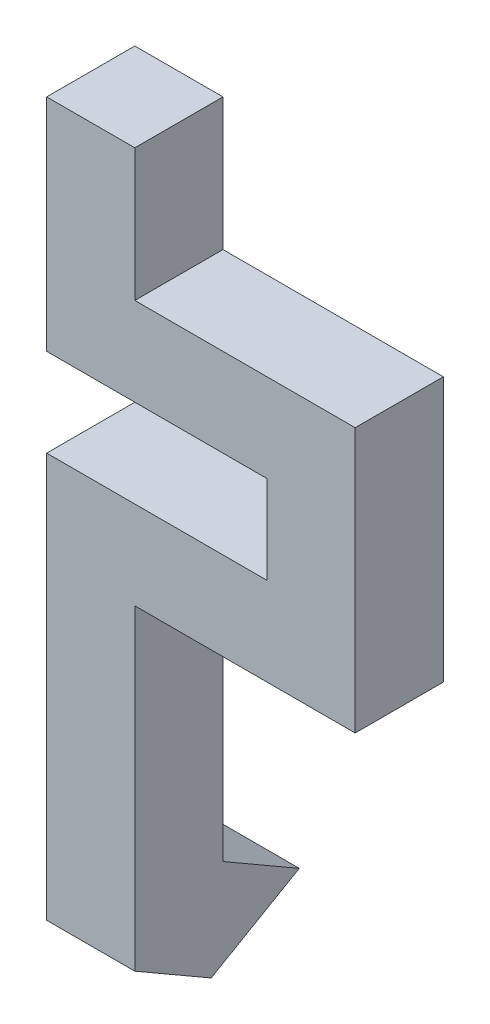
ISO-10303-21;
HEADER;
FILE_DESCRIPTION(('STEP AP214'),'2;1');
FILE_NAME('part.step','',(''),(''),'','','');
FILE_SCHEMA(('AUTOMOTIVE_DESIGN { 1 0 10303 214 1 1 1 1 }'));
ENDSEC;
DATA;
#1=APPLICATION_CONTEXT('core data for automotive mechanical design processes');
#2=APPLICATION_PROTOCOL_DEFINITION('international standard','automotive_design',2000,#1);
#3=PRODUCT_CONTEXT('',#1,'mechanical');
#4=PRODUCT('Part','Part','',(#3));
#5=PRODUCT_RELATED_PRODUCT_CATEGORY('part','',(#4));
#6=PRODUCT_DEFINITION_FORMATION('','',#4);
#7=PRODUCT_DEFINITION_CONTEXT('part definition',#1,'design');
#8=PRODUCT_DEFINITION('design','',#6,#7);
#9=PRODUCT_DEFINITION_SHAPE('','',#8);
#10=(LENGTH_UNIT() NAMED_UNIT(*) SI_UNIT(.MILLI.,.METRE.));
#11=(NAMED_UNIT(*) PLANE_ANGLE_UNIT() SI_UNIT($,.RADIAN.));
#12=(NAMED_UNIT(*) SI_UNIT($,.STERADIAN.) SOLID_ANGLE_UNIT());
#13=UNCERTAINTY_MEASURE_WITH_UNIT(LENGTH_MEASURE(1.E-05),#10,'distance_accuracy_value','');
#14=(GEOMETRIC_REPRESENTATION_CONTEXT(3) GLOBAL_UNCERTAINTY_ASSIGNED_CONTEXT((#13)) GLOBAL_UNIT_ASSIGNED_CONTEXT((#10,
#11,#12)) REPRESENTATION_CONTEXT('',''));
#15=CARTESIAN_POINT('',(0.,0.,0.));
#16=DIRECTION('',(0.,0.,1.));
#17=DIRECTION('',(1.,0.,0.));
#18=AXIS2_PLACEMENT_3D('',#15,#16,#17);
#19=CARTESIAN_POINT('',(2.,0.,2.));
#20=DIRECTION('',(1.,0.,0.));
#21=DIRECTION('',(0.,1.,0.));
#22=AXIS2_PLACEMENT_3D('',#19,#20,#21);
#23=PLANE('',#22);
#24=DIRECTION('',(0.,-1.,0.));
#25=VECTOR('',#24,1.);
#26=CARTESIAN_POINT('',(2.,0.,2.));
#27=LINE('',#26,#25);
#28=CARTESIAN_POINT('',(2.,-9.,2.));
#29=VERTEX_POINT('',#28);
#30=CARTESIAN_POINT('',(2.,-16.18,2.));
#31=VERTEX_POINT('',#30);
#32=EDGE_CURVE('E180',#29,#31,#27,.T.);
#33=ORIENTED_EDGE('',*,*,#32,.T.);
#34=DIRECTION('',(0.,0.499999999999999,0.866025403784439));
#35=VECTOR('',#34,1.);
#36=CARTESIAN_POINT('',(2.,-16.18,2.));
#37=LINE('',#36,#35);
#38=CARTESIAN_POINT('',(2.,-17.18,0.267949192431121));
#39=VERTEX_POINT('',#38);
#40=EDGE_CURVE('E247',#39,#31,#37,.T.);
#41=ORIENTED_EDGE('',*,*,#40,.F.);
#42=DIRECTION('',(0.,-0.500000000000003,0.866025403784437));
#43=VECTOR('',#42,1.);
#44=CARTESIAN_POINT('',(2.,-16.0252994616207,-1.73205080756887));
#45=LINE('',#44,#43);
#46=CARTESIAN_POINT('',(2.,-16.0252994616207,-1.73205080756887));
#47=VERTEX_POINT('',#46);
#48=EDGE_CURVE('E269',#47,#39,#45,.T.);
#49=ORIENTED_EDGE('',*,*,#48,.F.);
#50=DIRECTION('',(0.,-0.5,-0.866025403784439));
#51=VECTOR('',#50,1.);
#52=CARTESIAN_POINT('',(2.,-15.0252994616207,0.));
#53=LINE('',#52,#51);
#54=CARTESIAN_POINT('',(2.,-15.0252994616207,0.));
#55=VERTEX_POINT('',#54);
#56=EDGE_CURVE('E261',#55,#47,#53,.T.);
#57=ORIENTED_EDGE('',*,*,#56,.F.);
#58=DIRECTION('',(0.,-1.,0.));
#59=VECTOR('',#58,1.);
#60=CARTESIAN_POINT('',(2.,0.,0.));
#61=LINE('',#60,#59);
#62=CARTESIAN_POINT('',(2.,-9.,0.));
#63=VERTEX_POINT('',#62);
#64=EDGE_CURVE('E153',#63,#55,#61,.T.);
#65=ORIENTED_EDGE('',*,*,#64,.F.);
#66=DIRECTION('',(0.,0.,-1.));
#67=VECTOR('',#66,1.);
#68=CARTESIAN_POINT('',(2.,-9.,2.));
#69=LINE('',#68,#67);
#70=EDGE_CURVE('E11',#29,#63,#69,.T.);
#71=ORIENTED_EDGE('',*,*,#70,.F.);
#72=EDGE_LOOP('',(#33,#41,#49,#57,#65,#71));
#73=FACE_BOUND('',#72,.T.);
#74=ADVANCED_FACE('F35',(#73),#23,.T.);
#75=CARTESIAN_POINT('',(0.,-9.,2.));
#76=DIRECTION('',(0.,-1.,0.));
#77=DIRECTION('',(0.,0.,-1.));
#78=AXIS2_PLACEMENT_3D('',#75,#76,#77);
#79=PLANE('',#78);
#80=DIRECTION('',(-1.,0.,0.));
#81=VECTOR('',#80,1.);
#82=CARTESIAN_POINT('',(0.,-9.,0.));
#83=LINE('',#82,#81);
#84=CARTESIAN_POINT('',(7.,-9.,0.));
#85=VERTEX_POINT('',#84);
#86=EDGE_CURVE('E156',#85,#63,#83,.T.);
#87=ORIENTED_EDGE('',*,*,#86,.F.);
#88=DIRECTION('',(0.,0.,-1.));
#89=VECTOR('',#88,1.);
#90=CARTESIAN_POINT('',(7.,-9.,2.));
#91=LINE('',#90,#89);
#92=CARTESIAN_POINT('',(7.,-9.,2.));
#93=VERTEX_POINT('',#92);
#94=EDGE_CURVE('E43',#93,#85,#91,.T.);
#95=ORIENTED_EDGE('',*,*,#94,.F.);
#96=DIRECTION('',(-1.,0.,0.));
#97=VECTOR('',#96,1.);
#98=CARTESIAN_POINT('',(0.,-9.,2.));
#99=LINE('',#98,#97);
#100=EDGE_CURVE('E213',#93,#29,#99,.T.);
#101=ORIENTED_EDGE('',*,*,#100,.T.);
#102=ORIENTED_EDGE('',*,*,#70,.T.);
#103=EDGE_LOOP('',(#87,#95,#101,#102));
#104=FACE_BOUND('',#103,.T.);
#105=ADVANCED_FACE('F201',(#104),#79,.T.);
#106=CARTESIAN_POINT('',(7.,0.,2.));
#107=DIRECTION('',(1.,0.,0.));
#108=DIRECTION('',(0.,1.,0.));
#109=AXIS2_PLACEMENT_3D('',#106,#107,#108);
#110=PLANE('',#109);
#111=DIRECTION('',(0.,-1.,0.));
#112=VECTOR('',#111,1.);
#113=CARTESIAN_POINT('',(7.,0.,0.));
#114=LINE('',#113,#112);
#115=CARTESIAN_POINT('',(7.,-3.,0.));
#116=VERTEX_POINT('',#115);
#117=EDGE_CURVE('E160',#116,#85,#114,.T.);
#118=ORIENTED_EDGE('',*,*,#117,.F.);
#119=DIRECTION('',(0.,0.,-1.));
#120=VECTOR('',#119,1.);
#121=CARTESIAN_POINT('',(7.,-3.,2.));
#122=LINE('',#121,#120);
#123=CARTESIAN_POINT('',(7.,-3.,2.));
#124=VERTEX_POINT('',#123);
#125=EDGE_CURVE('E190',#124,#116,#122,.T.);
#126=ORIENTED_EDGE('',*,*,#125,.F.);
#127=DIRECTION('',(0.,-1.,0.));
#128=VECTOR('',#127,1.);
#129=CARTESIAN_POINT('',(7.,0.,2.));
#130=LINE('',#129,#128);
#131=EDGE_CURVE('E197',#124,#93,#130,.T.);
#132=ORIENTED_EDGE('',*,*,#131,.T.);
#133=ORIENTED_EDGE('',*,*,#94,.T.);
#134=EDGE_LOOP('',(#118,#126,#132,#133));
#135=FACE_BOUND('',#134,.T.);
#136=ADVANCED_FACE('F195',(#135),#110,.T.);
#137=CARTESIAN_POINT('',(0.,-3.,2.));
#138=DIRECTION('',(0.,1.,0.));
#139=DIRECTION('',(0.,0.,1.));
#140=AXIS2_PLACEMENT_3D('',#137,#138,#139);
#141=PLANE('',#140);
#142=DIRECTION('',(1.,0.,0.));
#143=VECTOR('',#142,1.);
#144=CARTESIAN_POINT('',(0.,-3.,0.));
#145=LINE('',#144,#143);
#146=CARTESIAN_POINT('',(2.,-3.,0.));
#147=VERTEX_POINT('',#146);
#148=EDGE_CURVE('E163',#147,#116,#145,.T.);
#149=ORIENTED_EDGE('',*,*,#148,.F.);
#150=DIRECTION('',(0.,0.,-1.));
#151=VECTOR('',#150,1.);
#152=CARTESIAN_POINT('',(2.,-3.,2.));
#153=LINE('',#152,#151);
#154=CARTESIAN_POINT('',(2.,-3.,2.));
#155=VERTEX_POINT('',#154);
#156=EDGE_CURVE('E188',#155,#147,#153,.T.);
#157=ORIENTED_EDGE('',*,*,#156,.F.);
#158=DIRECTION('',(1.,0.,0.));
#159=VECTOR('',#158,1.);
#160=CARTESIAN_POINT('',(0.,-3.,2.));
#161=LINE('',#160,#159);
#162=EDGE_CURVE('E210',#155,#124,#161,.T.);
#163=ORIENTED_EDGE('',*,*,#162,.T.);
#164=ORIENTED_EDGE('',*,*,#125,.T.);
#165=EDGE_LOOP('',(#149,#157,#163,#164));
#166=FACE_BOUND('',#165,.T.);
#167=ADVANCED_FACE('F207',(#166),#141,.T.);
#168=CARTESIAN_POINT('',(2.,0.,2.));
#169=DIRECTION('',(1.,0.,0.));
#170=DIRECTION('',(0.,1.,0.));
#171=AXIS2_PLACEMENT_3D('',#168,#169,#170);
#172=PLANE('',#171);
#173=DIRECTION('',(0.,-1.,0.));
#174=VECTOR('',#173,1.);
#175=CARTESIAN_POINT('',(2.,0.,0.));
#176=LINE('',#175,#174);
#177=CARTESIAN_POINT('',(2.,0.,0.));
#178=VERTEX_POINT('',#177);
#179=EDGE_CURVE('E166',#178,#147,#176,.T.);
#180=ORIENTED_EDGE('',*,*,#179,.F.);
#181=DIRECTION('',(0.,0.,-1.));
#182=VECTOR('',#181,1.);
#183=CARTESIAN_POINT('',(2.,0.,2.));
#184=LINE('',#183,#182);
#185=CARTESIAN_POINT('',(2.,0.,2.));
#186=VERTEX_POINT('',#185);
#187=EDGE_CURVE('E186',#186,#178,#184,.T.);
#188=ORIENTED_EDGE('',*,*,#187,.F.);
#189=DIRECTION('',(0.,-1.,0.));
#190=VECTOR('',#189,1.);
#191=CARTESIAN_POINT('',(2.,0.,2.));
#192=LINE('',#191,#190);
#193=EDGE_CURVE('E215',#186,#155,#192,.T.);
#194=ORIENTED_EDGE('',*,*,#193,.T.);
#195=ORIENTED_EDGE('',*,*,#156,.T.);
#196=EDGE_LOOP('',(#180,#188,#194,#195));
#197=FACE_BOUND('',#196,.T.);
#198=ADVANCED_FACE('F227',(#197),#172,.T.);
#199=CARTESIAN_POINT('',(0.,0.,2.));
#200=DIRECTION('',(0.,1.,0.));
#201=DIRECTION('',(0.,0.,1.));
#202=AXIS2_PLACEMENT_3D('',#199,#200,#201);
#203=PLANE('',#202);
#204=DIRECTION('',(1.,0.,0.));
#205=VECTOR('',#204,1.);
#206=CARTESIAN_POINT('',(0.,0.,0.));
#207=LINE('',#206,#205);
#208=CARTESIAN_POINT('',(0.,0.,0.));
#209=VERTEX_POINT('',#208);
#210=EDGE_CURVE('E169',#209,#178,#207,.T.);
#211=ORIENTED_EDGE('',*,*,#210,.F.);
#212=DIRECTION('',(0.,0.,-1.));
#213=VECTOR('',#212,1.);
#214=CARTESIAN_POINT('',(0.,0.,2.));
#215=LINE('',#214,#213);
#216=CARTESIAN_POINT('',(0.,0.,2.));
#217=VERTEX_POINT('',#216);
#218=EDGE_CURVE('E184',#217,#209,#215,.T.);
#219=ORIENTED_EDGE('',*,*,#218,.F.);
#220=DIRECTION('',(1.,0.,0.));
#221=VECTOR('',#220,1.);
#222=CARTESIAN_POINT('',(0.,0.,2.));
#223=LINE('',#222,#221);
#224=EDGE_CURVE('E221',#217,#186,#223,.T.);
#225=ORIENTED_EDGE('',*,*,#224,.T.);
#226=ORIENTED_EDGE('',*,*,#187,.T.);
#227=EDGE_LOOP('',(#211,#219,#225,#226));
#228=FACE_BOUND('',#227,.T.);
#229=ADVANCED_FACE('F225',(#228),#203,.T.);
#230=CARTESIAN_POINT('',(0.,0.,2.));
#231=DIRECTION('',(1.,0.,0.));
#232=DIRECTION('',(0.,1.,0.));
#233=AXIS2_PLACEMENT_3D('',#230,#231,#232);
#234=PLANE('',#233);
#235=DIRECTION('',(0.,-1.,0.));
#236=VECTOR('',#235,1.);
#237=CARTESIAN_POINT('',(0.,0.,0.));
#238=LINE('',#237,#236);
#239=CARTESIAN_POINT('',(0.,-5.,0.));
#240=VERTEX_POINT('',#239);
#241=EDGE_CURVE('E172',#209,#240,#238,.T.);
#242=ORIENTED_EDGE('',*,*,#241,.T.);
#243=DIRECTION('',(0.,0.,-1.));
#244=VECTOR('',#243,1.);
#245=CARTESIAN_POINT('',(0.,-5.,2.));
#246=LINE('',#245,#244);
#247=CARTESIAN_POINT('',(0.,-5.,2.));
#248=VERTEX_POINT('',#247);
#249=EDGE_CURVE('E139',#248,#240,#246,.T.);
#250=ORIENTED_EDGE('',*,*,#249,.F.);
#251=DIRECTION('',(0.,-1.,0.));
#252=VECTOR('',#251,1.);
#253=CARTESIAN_POINT('',(0.,0.,2.));
#254=LINE('',#253,#252);
#255=EDGE_CURVE('E130',#217,#248,#254,.T.);
#256=ORIENTED_EDGE('',*,*,#255,.F.);
#257=ORIENTED_EDGE('',*,*,#218,.T.);
#258=EDGE_LOOP('',(#242,#250,#256,#257));
#259=FACE_BOUND('',#258,.T.);
#260=ADVANCED_FACE('F230',(#259),#234,.F.);
#261=CARTESIAN_POINT('',(0.,-5.,2.));
#262=DIRECTION('',(0.,1.,0.));
#263=DIRECTION('',(-1.,0.,0.));
#264=AXIS2_PLACEMENT_3D('',#261,#262,#263);
#265=PLANE('',#264);
#266=DIRECTION('',(1.,0.,0.));
#267=VECTOR('',#266,1.);
#268=CARTESIAN_POINT('',(0.,-5.,0.));
#269=LINE('',#268,#267);
#270=CARTESIAN_POINT('',(5.,-5.,0.));
#271=VERTEX_POINT('',#270);
#272=EDGE_CURVE('E138',#240,#271,#269,.T.);
#273=ORIENTED_EDGE('',*,*,#272,.T.);
#274=DIRECTION('',(0.,0.,-1.));
#275=VECTOR('',#274,1.);
#276=CARTESIAN_POINT('',(5.,-5.,2.));
#277=LINE('',#276,#275);
#278=CARTESIAN_POINT('',(5.,-5.,2.));
#279=VERTEX_POINT('',#278);
#280=EDGE_CURVE('E135',#279,#271,#277,.T.);
#281=ORIENTED_EDGE('',*,*,#280,.F.);
#282=DIRECTION('',(1.,0.,0.));
#283=VECTOR('',#282,1.);
#284=CARTESIAN_POINT('',(0.,-5.,2.));
#285=LINE('',#284,#283);
#286=EDGE_CURVE('E123',#248,#279,#285,.T.);
#287=ORIENTED_EDGE('',*,*,#286,.F.);
#288=ORIENTED_EDGE('',*,*,#249,.T.);
#289=EDGE_LOOP('',(#273,#281,#287,#288));
#290=FACE_BOUND('',#289,.T.);
#291=ADVANCED_FACE('F136',(#290),#265,.F.);
#292=CARTESIAN_POINT('',(5.,0.,2.));
#293=DIRECTION('',(1.,0.,0.));
#294=DIRECTION('',(0.,0.,-1.));
#295=AXIS2_PLACEMENT_3D('',#292,#293,#294);
#296=PLANE('',#295);
#297=DIRECTION('',(0.,-1.,0.));
#298=VECTOR('',#297,1.);
#299=CARTESIAN_POINT('',(5.,0.,0.));
#300=LINE('',#299,#298);
#301=CARTESIAN_POINT('',(5.,-7.,0.));
#302=VERTEX_POINT('',#301);
#303=EDGE_CURVE('E86',#271,#302,#300,.T.);
#304=ORIENTED_EDGE('',*,*,#303,.T.);
#305=DIRECTION('',(0.,0.,-1.));
#306=VECTOR('',#305,1.);
#307=CARTESIAN_POINT('',(5.,-7.,2.));
#308=LINE('',#307,#306);
#309=CARTESIAN_POINT('',(5.,-7.,2.));
#310=VERTEX_POINT('',#309);
#311=EDGE_CURVE('E140',#310,#302,#308,.T.);
#312=ORIENTED_EDGE('',*,*,#311,.F.);
#313=DIRECTION('',(0.,-1.,0.));
#314=VECTOR('',#313,1.);
#315=CARTESIAN_POINT('',(5.,0.,2.));
#316=LINE('',#315,#314);
#317=EDGE_CURVE('E127',#279,#310,#316,.T.);
#318=ORIENTED_EDGE('',*,*,#317,.F.);
#319=ORIENTED_EDGE('',*,*,#280,.T.);
#320=EDGE_LOOP('',(#304,#312,#318,#319));
#321=FACE_BOUND('',#320,.T.);
#322=ADVANCED_FACE('F142',(#321),#296,.F.);
#323=CARTESIAN_POINT('',(0.,-7.,2.));
#324=DIRECTION('',(0.,-1.,0.));
#325=DIRECTION('',(1.,0.,0.));
#326=AXIS2_PLACEMENT_3D('',#323,#324,#325);
#327=PLANE('',#326);
#328=DIRECTION('',(-1.,0.,0.));
#329=VECTOR('',#328,1.);
#330=CARTESIAN_POINT('',(0.,-7.,0.));
#331=LINE('',#330,#329);
#332=CARTESIAN_POINT('',(0.,-7.,0.));
#333=VERTEX_POINT('',#332);
#334=EDGE_CURVE('E92',#302,#333,#331,.T.);
#335=ORIENTED_EDGE('',*,*,#334,.T.);
#336=DIRECTION('',(0.,0.,-1.));
#337=VECTOR('',#336,1.);
#338=CARTESIAN_POINT('',(0.,-7.,2.));
#339=LINE('',#338,#337);
#340=CARTESIAN_POINT('',(0.,-7.,2.));
#341=VERTEX_POINT('',#340);
#342=EDGE_CURVE('E152',#341,#333,#339,.T.);
#343=ORIENTED_EDGE('',*,*,#342,.F.);
#344=DIRECTION('',(-1.,0.,0.));
#345=VECTOR('',#344,1.);
#346=CARTESIAN_POINT('',(0.,-7.,2.));
#347=LINE('',#346,#345);
#348=EDGE_CURVE('E51',#310,#341,#347,.T.);
#349=ORIENTED_EDGE('',*,*,#348,.F.);
#350=ORIENTED_EDGE('',*,*,#311,.T.);
#351=EDGE_LOOP('',(#335,#343,#349,#350));
#352=FACE_BOUND('',#351,.T.);
#353=ADVANCED_FACE('F291',(#352),#327,.F.);
#354=CARTESIAN_POINT('',(0.,0.,2.));
#355=DIRECTION('',(1.,0.,0.));
#356=DIRECTION('',(0.,1.,0.));
#357=AXIS2_PLACEMENT_3D('',#354,#355,#356);
#358=PLANE('',#357);
#359=DIRECTION('',(0.,-1.,0.));
#360=VECTOR('',#359,1.);
#361=CARTESIAN_POINT('',(0.,0.,0.));
#362=LINE('',#361,#360);
#363=CARTESIAN_POINT('',(0.,-15.0252994616207,0.));
#364=VERTEX_POINT('',#363);
#365=EDGE_CURVE('E177',#333,#364,#362,.T.);
#366=ORIENTED_EDGE('',*,*,#365,.T.);
#367=DIRECTION('',(0.,-0.5,-0.866025403784439));
#368=VECTOR('',#367,1.);
#369=CARTESIAN_POINT('',(0.,-15.0252994616207,0.));
#370=LINE('',#369,#368);
#371=CARTESIAN_POINT('',(0.,-16.0252994616207,-1.73205080756887));
#372=VERTEX_POINT('',#371);
#373=EDGE_CURVE('E265',#364,#372,#370,.T.);
#374=ORIENTED_EDGE('',*,*,#373,.T.);
#375=DIRECTION('',(0.,-0.500000000000003,0.866025403784437));
#376=VECTOR('',#375,1.);
#377=CARTESIAN_POINT('',(0.,-16.0252994616207,-1.73205080756887));
#378=LINE('',#377,#376);
#379=CARTESIAN_POINT('',(0.,-17.18,0.267949192431121));
#380=VERTEX_POINT('',#379);
#381=EDGE_CURVE('E262',#372,#380,#378,.T.);
#382=ORIENTED_EDGE('',*,*,#381,.T.);
#383=DIRECTION('',(0.,0.499999999999999,0.866025403784439));
#384=VECTOR('',#383,1.);
#385=CARTESIAN_POINT('',(0.,-16.18,2.));
#386=LINE('',#385,#384);
#387=CARTESIAN_POINT('',(0.,-16.18,2.));
#388=VERTEX_POINT('',#387);
#389=EDGE_CURVE('E258',#380,#388,#386,.T.);
#390=ORIENTED_EDGE('',*,*,#389,.T.);
#391=DIRECTION('',(0.,-1.,0.));
#392=VECTOR('',#391,1.);
#393=CARTESIAN_POINT('',(0.,0.,2.));
#394=LINE('',#393,#392);
#395=EDGE_CURVE('E144',#341,#388,#394,.T.);
#396=ORIENTED_EDGE('',*,*,#395,.F.);
#397=ORIENTED_EDGE('',*,*,#342,.T.);
#398=EDGE_LOOP('',(#366,#374,#382,#390,#396,#397));
#399=FACE_BOUND('',#398,.T.);
#400=ADVANCED_FACE('F289',(#399),#358,.F.);
#401=CARTESIAN_POINT('',(0.,0.,2.));
#402=DIRECTION('',(0.,0.,1.));
#403=DIRECTION('',(1.,0.,0.));
#404=AXIS2_PLACEMENT_3D('',#401,#402,#403);
#405=PLANE('',#404);
#406=ORIENTED_EDGE('',*,*,#32,.F.);
#407=ORIENTED_EDGE('',*,*,#100,.F.);
#408=ORIENTED_EDGE('',*,*,#131,.F.);
#409=ORIENTED_EDGE('',*,*,#162,.F.);
#410=ORIENTED_EDGE('',*,*,#193,.F.);
#411=ORIENTED_EDGE('',*,*,#224,.F.);
#412=ORIENTED_EDGE('',*,*,#255,.T.);
#413=ORIENTED_EDGE('',*,*,#286,.T.);
#414=ORIENTED_EDGE('',*,*,#317,.T.);
#415=ORIENTED_EDGE('',*,*,#348,.T.);
#416=ORIENTED_EDGE('',*,*,#395,.T.);
#417=DIRECTION('',(1.,0.,0.));
#418=VECTOR('',#417,1.);
#419=CARTESIAN_POINT('',(0.,-16.18,2.));
#420=LINE('',#419,#418);
#421=EDGE_CURVE('E149',#388,#31,#420,.T.);
#422=ORIENTED_EDGE('',*,*,#421,.T.);
#423=EDGE_LOOP('',(#406,#407,#408,#409,#410,#411,#412,#413,#414,#415,#416,#422));
#424=FACE_BOUND('',#423,.T.);
#425=ADVANCED_FACE('F125',(#424),#405,.T.);
#426=CARTESIAN_POINT('',(0.,0.,0.));
#427=DIRECTION('',(0.,0.,1.));
#428=DIRECTION('',(1.,0.,0.));
#429=AXIS2_PLACEMENT_3D('',#426,#427,#428);
#430=PLANE('',#429);
#431=ORIENTED_EDGE('',*,*,#64,.T.);
#432=DIRECTION('',(-1.,0.,0.));
#433=VECTOR('',#432,1.);
#434=CARTESIAN_POINT('',(2.,-15.0252994616207,0.));
#435=LINE('',#434,#433);
#436=EDGE_CURVE('E250',#55,#364,#435,.T.);
#437=ORIENTED_EDGE('',*,*,#436,.T.);
#438=ORIENTED_EDGE('',*,*,#365,.F.);
#439=ORIENTED_EDGE('',*,*,#334,.F.);
#440=ORIENTED_EDGE('',*,*,#303,.F.);
#441=ORIENTED_EDGE('',*,*,#272,.F.);
#442=ORIENTED_EDGE('',*,*,#241,.F.);
#443=ORIENTED_EDGE('',*,*,#210,.T.);
#444=ORIENTED_EDGE('',*,*,#179,.T.);
#445=ORIENTED_EDGE('',*,*,#148,.T.);
#446=ORIENTED_EDGE('',*,*,#117,.T.);
#447=ORIENTED_EDGE('',*,*,#86,.T.);
#448=EDGE_LOOP('',(#431,#437,#438,#439,#440,#441,#442,#443,#444,#445,#446,#447));
#449=FACE_BOUND('',#448,.T.);
#450=ADVANCED_FACE('F203',(#449),#430,.F.);
#451=CARTESIAN_POINT('',(2.,-16.18,2.));
#452=DIRECTION('',(0.,-0.866025403784439,0.499999999999999));
#453=DIRECTION('',(0.,-0.499999999999999,-0.866025403784439));
#454=AXIS2_PLACEMENT_3D('',#451,#452,#453);
#455=PLANE('',#454);
#456=ORIENTED_EDGE('',*,*,#389,.F.);
#457=DIRECTION('',(-1.,0.,0.));
#458=VECTOR('',#457,1.);
#459=CARTESIAN_POINT('',(2.,-17.18,0.267949192431121));
#460=LINE('',#459,#458);
#461=EDGE_CURVE('E157',#39,#380,#460,.T.);
#462=ORIENTED_EDGE('',*,*,#461,.F.);
#463=ORIENTED_EDGE('',*,*,#40,.T.);
#464=ORIENTED_EDGE('',*,*,#421,.F.);
#465=EDGE_LOOP('',(#456,#462,#463,#464));
#466=FACE_BOUND('',#465,.T.);
#467=ADVANCED_FACE('F303',(#466),#455,.T.);
#468=CARTESIAN_POINT('',(2.,-16.0252994616207,-1.73205080756887));
#469=DIRECTION('',(0.,-0.866025403784437,-0.500000000000003));
#470=DIRECTION('',(0.,0.500000000000003,-0.866025403784437));
#471=AXIS2_PLACEMENT_3D('',#468,#469,#470);
#472=PLANE('',#471);
#473=ORIENTED_EDGE('',*,*,#381,.F.);
#474=DIRECTION('',(-1.,0.,0.));
#475=VECTOR('',#474,1.);
#476=CARTESIAN_POINT('',(2.,-16.0252994616207,-1.73205080756887));
#477=LINE('',#476,#475);
#478=EDGE_CURVE('E253',#47,#372,#477,.T.);
#479=ORIENTED_EDGE('',*,*,#478,.F.);
#480=ORIENTED_EDGE('',*,*,#48,.T.);
#481=ORIENTED_EDGE('',*,*,#461,.T.);
#482=EDGE_LOOP('',(#473,#479,#480,#481));
#483=FACE_BOUND('',#482,.T.);
#484=ADVANCED_FACE('F308',(#483),#472,.T.);
#485=CARTESIAN_POINT('',(2.,-15.0252994616207,0.));
#486=DIRECTION('',(0.,0.866025403784439,-0.5));
#487=DIRECTION('',(0.,0.5,0.866025403784439));
#488=AXIS2_PLACEMENT_3D('',#485,#486,#487);
#489=PLANE('',#488);
#490=ORIENTED_EDGE('',*,*,#373,.F.);
#491=ORIENTED_EDGE('',*,*,#436,.F.);
#492=ORIENTED_EDGE('',*,*,#56,.T.);
#493=ORIENTED_EDGE('',*,*,#478,.T.);
#494=EDGE_LOOP('',(#490,#491,#492,#493));
#495=FACE_BOUND('',#494,.T.);
#496=ADVANCED_FACE('F278',(#495),#489,.T.);
#497=CLOSED_SHELL('',(#74,#105,#136,#167,#198,#229,#260,#291,#322,#353,#400,#425,#450,#467,#484,#496));
#498=MANIFOLD_SOLID_BREP('B2',#497);
#499=ADVANCED_BREP_SHAPE_REPRESENTATION('',(#18,#498),#14);
#500=SHAPE_DEFINITION_REPRESENTATION(#9,#499);
ENDSEC;
END-ISO-10303-21;
